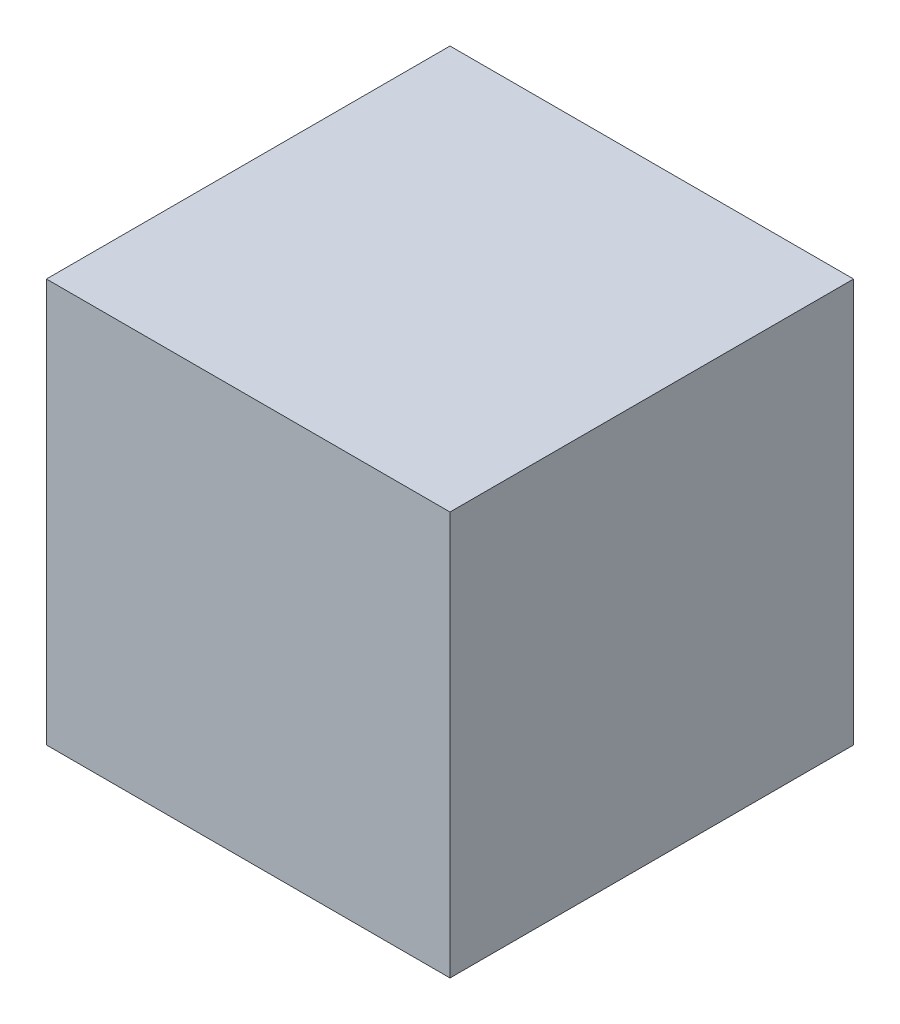
ISO-10303-21;
HEADER;
FILE_DESCRIPTION(('STEP AP214'),'2;1');
FILE_NAME('part.step','',(''),(''),'','','');
FILE_SCHEMA(('AUTOMOTIVE_DESIGN { 1 0 10303 214 1 1 1 1 }'));
ENDSEC;
DATA;
#1=APPLICATION_CONTEXT('core data for automotive mechanical design processes');
#2=APPLICATION_PROTOCOL_DEFINITION('international standard','automotive_design',2000,#1);
#3=PRODUCT_CONTEXT('',#1,'mechanical');
#4=PRODUCT('Part','Part','',(#3));
#5=PRODUCT_RELATED_PRODUCT_CATEGORY('part','',(#4));
#6=PRODUCT_DEFINITION_FORMATION('','',#4);
#7=PRODUCT_DEFINITION_CONTEXT('part definition',#1,'design');
#8=PRODUCT_DEFINITION('design','',#6,#7);
#9=PRODUCT_DEFINITION_SHAPE('','',#8);
#10=(LENGTH_UNIT() NAMED_UNIT(*) SI_UNIT(.MILLI.,.METRE.));
#11=(NAMED_UNIT(*) PLANE_ANGLE_UNIT() SI_UNIT($,.RADIAN.));
#12=(NAMED_UNIT(*) SI_UNIT($,.STERADIAN.) SOLID_ANGLE_UNIT());
#13=UNCERTAINTY_MEASURE_WITH_UNIT(LENGTH_MEASURE(1.E-05),#10,'distance_accuracy_value','');
#14=(GEOMETRIC_REPRESENTATION_CONTEXT(3) GLOBAL_UNCERTAINTY_ASSIGNED_CONTEXT((#13)) GLOBAL_UNIT_ASSIGNED_CONTEXT((#10,
#11,#12)) REPRESENTATION_CONTEXT('',''));
#15=CARTESIAN_POINT('',(0.,0.,0.));
#16=DIRECTION('',(0.,0.,1.));
#17=DIRECTION('',(1.,0.,0.));
#18=AXIS2_PLACEMENT_3D('',#15,#16,#17);
#19=CARTESIAN_POINT('',(15.,30.,-15.));
#20=DIRECTION('',(-1.,0.,0.));
#21=DIRECTION('',(0.,0.,1.));
#22=AXIS2_PLACEMENT_3D('',#19,#20,#21);
#23=PLANE('',#22);
#24=DIRECTION('',(0.,0.,-1.));
#25=VECTOR('',#24,1.);
#26=CARTESIAN_POINT('',(15.,0.,-15.));
#27=LINE('',#26,#25);
#28=CARTESIAN_POINT('',(15.,0.,15.));
#29=VERTEX_POINT('',#28);
#30=CARTESIAN_POINT('',(15.,0.,-15.));
#31=VERTEX_POINT('',#30);
#32=EDGE_CURVE('E101',#29,#31,#27,.T.);
#33=ORIENTED_EDGE('',*,*,#32,.T.);
#34=DIRECTION('',(0.,-1.,0.));
#35=VECTOR('',#34,1.);
#36=CARTESIAN_POINT('',(15.,30.,-15.));
#37=LINE('',#36,#35);
#38=CARTESIAN_POINT('',(15.,30.,-15.));
#39=VERTEX_POINT('',#38);
#40=EDGE_CURVE('E11',#39,#31,#37,.T.);
#41=ORIENTED_EDGE('',*,*,#40,.F.);
#42=DIRECTION('',(0.,0.,-1.));
#43=VECTOR('',#42,1.);
#44=CARTESIAN_POINT('',(15.,30.,-15.));
#45=LINE('',#44,#43);
#46=CARTESIAN_POINT('',(15.,30.,15.));
#47=VERTEX_POINT('',#46);
#48=EDGE_CURVE('E89',#47,#39,#45,.T.);
#49=ORIENTED_EDGE('',*,*,#48,.F.);
#50=DIRECTION('',(0.,-1.,0.));
#51=VECTOR('',#50,1.);
#52=CARTESIAN_POINT('',(15.,30.,15.));
#53=LINE('',#52,#51);
#54=EDGE_CURVE('E97',#47,#29,#53,.T.);
#55=ORIENTED_EDGE('',*,*,#54,.T.);
#56=EDGE_LOOP('',(#33,#41,#49,#55));
#57=FACE_BOUND('',#56,.T.);
#58=ADVANCED_FACE('F38',(#57),#23,.F.);
#59=CARTESIAN_POINT('',(-15.,30.,-15.));
#60=DIRECTION('',(0.,0.,1.));
#61=DIRECTION('',(1.,0.,0.));
#62=AXIS2_PLACEMENT_3D('',#59,#60,#61);
#63=PLANE('',#62);
#64=DIRECTION('',(-1.,0.,0.));
#65=VECTOR('',#64,1.);
#66=CARTESIAN_POINT('',(-15.,0.,-15.));
#67=LINE('',#66,#65);
#68=CARTESIAN_POINT('',(-15.,0.,-15.));
#69=VERTEX_POINT('',#68);
#70=EDGE_CURVE('E93',#31,#69,#67,.T.);
#71=ORIENTED_EDGE('',*,*,#70,.T.);
#72=DIRECTION('',(0.,-1.,0.));
#73=VECTOR('',#72,1.);
#74=CARTESIAN_POINT('',(-15.,30.,-15.));
#75=LINE('',#74,#73);
#76=CARTESIAN_POINT('',(-15.,30.,-15.));
#77=VERTEX_POINT('',#76);
#78=EDGE_CURVE('E46',#77,#69,#75,.T.);
#79=ORIENTED_EDGE('',*,*,#78,.F.);
#80=DIRECTION('',(-1.,0.,0.));
#81=VECTOR('',#80,1.);
#82=CARTESIAN_POINT('',(-15.,30.,-15.));
#83=LINE('',#82,#81);
#84=EDGE_CURVE('E84',#39,#77,#83,.T.);
#85=ORIENTED_EDGE('',*,*,#84,.F.);
#86=ORIENTED_EDGE('',*,*,#40,.T.);
#87=EDGE_LOOP('',(#71,#79,#85,#86));
#88=FACE_BOUND('',#87,.T.);
#89=ADVANCED_FACE('F92',(#88),#63,.F.);
#90=CARTESIAN_POINT('',(-15.,30.,-15.));
#91=DIRECTION('',(1.,0.,0.));
#92=DIRECTION('',(0.,0.,-1.));
#93=AXIS2_PLACEMENT_3D('',#90,#91,#92);
#94=PLANE('',#93);
#95=DIRECTION('',(0.,0.,1.));
#96=VECTOR('',#95,1.);
#97=CARTESIAN_POINT('',(-15.,0.,-15.));
#98=LINE('',#97,#96);
#99=CARTESIAN_POINT('',(-15.,0.,15.));
#100=VERTEX_POINT('',#99);
#101=EDGE_CURVE('E71',#69,#100,#98,.T.);
#102=ORIENTED_EDGE('',*,*,#101,.T.);
#103=DIRECTION('',(0.,-1.,0.));
#104=VECTOR('',#103,1.);
#105=CARTESIAN_POINT('',(-15.,30.,15.));
#106=LINE('',#105,#104);
#107=CARTESIAN_POINT('',(-15.,30.,15.));
#108=VERTEX_POINT('',#107);
#109=EDGE_CURVE('E94',#108,#100,#106,.T.);
#110=ORIENTED_EDGE('',*,*,#109,.F.);
#111=DIRECTION('',(0.,0.,1.));
#112=VECTOR('',#111,1.);
#113=CARTESIAN_POINT('',(-15.,30.,-15.));
#114=LINE('',#113,#112);
#115=EDGE_CURVE('E87',#77,#108,#114,.T.);
#116=ORIENTED_EDGE('',*,*,#115,.F.);
#117=ORIENTED_EDGE('',*,*,#78,.T.);
#118=EDGE_LOOP('',(#102,#110,#116,#117));
#119=FACE_BOUND('',#118,.T.);
#120=ADVANCED_FACE('F95',(#119),#94,.F.);
#121=CARTESIAN_POINT('',(-15.,30.,15.));
#122=DIRECTION('',(0.,0.,-1.));
#123=DIRECTION('',(-1.,0.,0.));
#124=AXIS2_PLACEMENT_3D('',#121,#122,#123);
#125=PLANE('',#124);
#126=DIRECTION('',(1.,0.,0.));
#127=VECTOR('',#126,1.);
#128=CARTESIAN_POINT('',(-15.,0.,15.));
#129=LINE('',#128,#127);
#130=EDGE_CURVE('E77',#100,#29,#129,.T.);
#131=ORIENTED_EDGE('',*,*,#130,.T.);
#132=ORIENTED_EDGE('',*,*,#54,.F.);
#133=DIRECTION('',(1.,0.,0.));
#134=VECTOR('',#133,1.);
#135=CARTESIAN_POINT('',(-15.,30.,15.));
#136=LINE('',#135,#134);
#137=EDGE_CURVE('E54',#108,#47,#136,.T.);
#138=ORIENTED_EDGE('',*,*,#137,.F.);
#139=ORIENTED_EDGE('',*,*,#109,.T.);
#140=EDGE_LOOP('',(#131,#132,#138,#139));
#141=FACE_BOUND('',#140,.T.);
#142=ADVANCED_FACE('F108',(#141),#125,.F.);
#143=CARTESIAN_POINT('',(0.,30.,0.));
#144=DIRECTION('',(0.,1.,0.));
#145=DIRECTION('',(0.,0.,1.));
#146=AXIS2_PLACEMENT_3D('',#143,#144,#145);
#147=PLANE('',#146);
#148=ORIENTED_EDGE('',*,*,#48,.T.);
#149=ORIENTED_EDGE('',*,*,#84,.T.);
#150=ORIENTED_EDGE('',*,*,#115,.T.);
#151=ORIENTED_EDGE('',*,*,#137,.T.);
#152=EDGE_LOOP('',(#148,#149,#150,#151));
#153=FACE_BOUND('',#152,.T.);
#154=ADVANCED_FACE('F85',(#153),#147,.T.);
#155=CARTESIAN_POINT('',(0.,0.,0.));
#156=DIRECTION('',(0.,1.,0.));
#157=DIRECTION('',(0.,0.,1.));
#158=AXIS2_PLACEMENT_3D('',#155,#156,#157);
#159=PLANE('',#158);
#160=ORIENTED_EDGE('',*,*,#32,.F.);
#161=ORIENTED_EDGE('',*,*,#130,.F.);
#162=ORIENTED_EDGE('',*,*,#101,.F.);
#163=ORIENTED_EDGE('',*,*,#70,.F.);
#164=EDGE_LOOP('',(#160,#161,#162,#163));
#165=FACE_BOUND('',#164,.T.);
#166=ADVANCED_FACE('F111',(#165),#159,.F.);
#167=CLOSED_SHELL('',(#58,#89,#120,#142,#154,#166));
#168=MANIFOLD_SOLID_BREP('B2',#167);
#169=ADVANCED_BREP_SHAPE_REPRESENTATION('',(#18,#168),#14);
#170=SHAPE_DEFINITION_REPRESENTATION(#9,#169);
ENDSEC;
END-ISO-10303-21;
